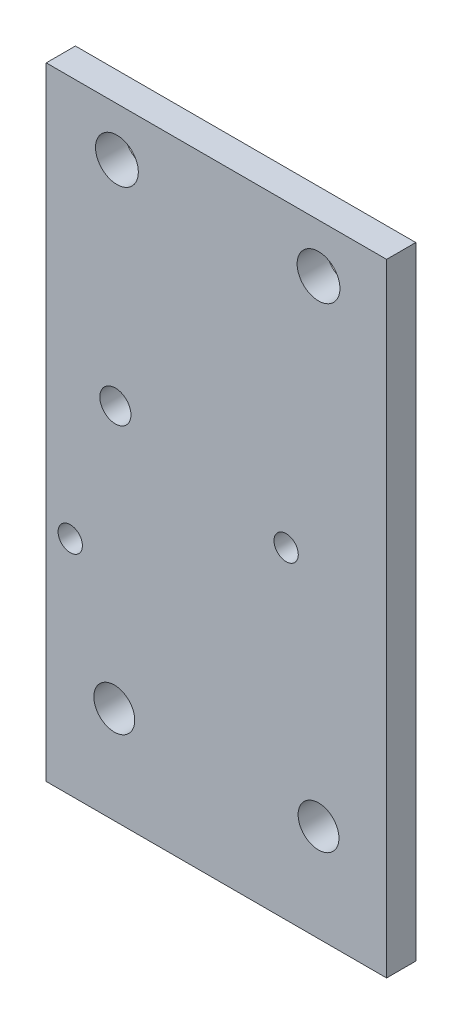
ISO-10303-21;
HEADER;
FILE_DESCRIPTION(('STEP AP214'),'2;1');
FILE_NAME('part.step','',(''),(''),'','','');
FILE_SCHEMA(('AUTOMOTIVE_DESIGN { 1 0 10303 214 1 1 1 1 }'));
ENDSEC;
DATA;
#1=APPLICATION_CONTEXT('core data for automotive mechanical design processes');
#2=APPLICATION_PROTOCOL_DEFINITION('international standard','automotive_design',2000,#1);
#3=PRODUCT_CONTEXT('',#1,'mechanical');
#4=PRODUCT('Part','Part','',(#3));
#5=PRODUCT_RELATED_PRODUCT_CATEGORY('part','',(#4));
#6=PRODUCT_DEFINITION_FORMATION('','',#4);
#7=PRODUCT_DEFINITION_CONTEXT('part definition',#1,'design');
#8=PRODUCT_DEFINITION('design','',#6,#7);
#9=PRODUCT_DEFINITION_SHAPE('','',#8);
#10=(LENGTH_UNIT() NAMED_UNIT(*) SI_UNIT(.MILLI.,.METRE.));
#11=(NAMED_UNIT(*) PLANE_ANGLE_UNIT() SI_UNIT($,.RADIAN.));
#12=(NAMED_UNIT(*) SI_UNIT($,.STERADIAN.) SOLID_ANGLE_UNIT());
#13=UNCERTAINTY_MEASURE_WITH_UNIT(LENGTH_MEASURE(1.E-05),#10,'distance_accuracy_value','');
#14=(GEOMETRIC_REPRESENTATION_CONTEXT(3) GLOBAL_UNCERTAINTY_ASSIGNED_CONTEXT((#13)) GLOBAL_UNIT_ASSIGNED_CONTEXT((#10,
#11,#12)) REPRESENTATION_CONTEXT('',''));
#15=CARTESIAN_POINT('',(0.,0.,0.));
#16=DIRECTION('',(0.,0.,1.));
#17=DIRECTION('',(1.,0.,0.));
#18=AXIS2_PLACEMENT_3D('',#15,#16,#17);
#19=CARTESIAN_POINT('',(0.,0.,3.));
#20=DIRECTION('',(0.,0.,1.));
#21=DIRECTION('',(1.,0.,0.));
#22=AXIS2_PLACEMENT_3D('',#19,#20,#21);
#23=PLANE('',#22);
#24=CARTESIAN_POINT('',(31.47,-21.64,3.));
#25=DIRECTION('',(0.,0.,1.));
#26=DIRECTION('',(1.,0.,0.));
#27=AXIS2_PLACEMENT_3D('',#24,#25,#26);
#28=CIRCLE('',#27,1.24999999999999);
#29=CARTESIAN_POINT('',(32.72,-21.64,3.));
#30=VERTEX_POINT('',#29);
#31=EDGE_CURVE('E143',#30,#30,#28,.T.);
#32=ORIENTED_EDGE('',*,*,#31,.F.);
#33=EDGE_LOOP('',(#32));
#34=FACE_BOUND('',#33,.T.);
#35=CARTESIAN_POINT('',(53.67,-11.34,3.));
#36=DIRECTION('',(0.,0.,1.));
#37=DIRECTION('',(1.,0.,0.));
#38=AXIS2_PLACEMENT_3D('',#35,#36,#37);
#39=CIRCLE('',#38,1.24999999999999);
#40=CARTESIAN_POINT('',(54.92,-11.34,3.));
#41=VERTEX_POINT('',#40);
#42=EDGE_CURVE('E135',#41,#41,#39,.T.);
#43=ORIENTED_EDGE('',*,*,#42,.F.);
#44=EDGE_LOOP('',(#43));
#45=FACE_BOUND('',#44,.T.);
#46=DIRECTION('',(1.,0.,0.));
#47=VECTOR('',#46,1.);
#48=CARTESIAN_POINT('',(29.,19.5,3.));
#49=LINE('',#48,#47);
#50=CARTESIAN_POINT('',(29.,19.5,3.));
#51=VERTEX_POINT('',#50);
#52=CARTESIAN_POINT('',(64.,19.5,3.));
#53=VERTEX_POINT('',#52);
#54=EDGE_CURVE('E76',#51,#53,#49,.T.);
#55=ORIENTED_EDGE('',*,*,#54,.F.);
#56=DIRECTION('',(0.,1.,0.));
#57=VECTOR('',#56,1.);
#58=CARTESIAN_POINT('',(29.,34.5,3.));
#59=LINE('',#58,#57);
#60=CARTESIAN_POINT('',(29.,-44.5,3.));
#61=VERTEX_POINT('',#60);
#62=EDGE_CURVE('E86',#61,#51,#59,.T.);
#63=ORIENTED_EDGE('',*,*,#62,.F.);
#64=DIRECTION('',(-1.,0.,0.));
#65=VECTOR('',#64,1.);
#66=CARTESIAN_POINT('',(21.,-44.5,3.));
#67=LINE('',#66,#65);
#68=CARTESIAN_POINT('',(64.,-44.5,3.));
#69=VERTEX_POINT('',#68);
#70=EDGE_CURVE('E119',#69,#61,#67,.T.);
#71=ORIENTED_EDGE('',*,*,#70,.F.);
#72=DIRECTION('',(0.,-1.,0.));
#73=VECTOR('',#72,1.);
#74=CARTESIAN_POINT('',(64.,24.5,3.));
#75=LINE('',#74,#73);
#76=EDGE_CURVE('E11',#53,#69,#75,.T.);
#77=ORIENTED_EDGE('',*,*,#76,.F.);
#78=EDGE_LOOP('',(#55,#63,#71,#77));
#79=FACE_BOUND('',#78,.T.);
#80=CARTESIAN_POINT('',(36.11,-7.5,3.));
#81=DIRECTION('',(0.,0.,1.));
#82=DIRECTION('',(1.,0.,0.));
#83=AXIS2_PLACEMENT_3D('',#80,#81,#82);
#84=CIRCLE('',#83,1.6);
#85=CARTESIAN_POINT('',(37.71,-7.5,3.));
#86=VERTEX_POINT('',#85);
#87=EDGE_CURVE('E95',#86,#86,#84,.T.);
#88=ORIENTED_EDGE('',*,*,#87,.F.);
#89=EDGE_LOOP('',(#88));
#90=FACE_BOUND('',#89,.T.);
#91=CARTESIAN_POINT('',(36.27,14.5,3.));
#92=DIRECTION('',(0.,0.,1.));
#93=DIRECTION('',(1.,0.,0.));
#94=AXIS2_PLACEMENT_3D('',#91,#92,#93);
#95=CIRCLE('',#94,2.2);
#96=CARTESIAN_POINT('',(38.47,14.5,3.));
#97=VERTEX_POINT('',#96);
#98=EDGE_CURVE('E111',#97,#97,#95,.T.);
#99=ORIENTED_EDGE('',*,*,#98,.F.);
#100=EDGE_LOOP('',(#99));
#101=FACE_BOUND('',#100,.T.);
#102=CARTESIAN_POINT('',(57.0000000000002,14.5,3.));
#103=DIRECTION('',(0.,0.,1.));
#104=DIRECTION('',(1.,0.,0.));
#105=AXIS2_PLACEMENT_3D('',#102,#103,#104);
#106=CIRCLE('',#105,2.2);
#107=CARTESIAN_POINT('',(59.2000000000002,14.5,3.));
#108=VERTEX_POINT('',#107);
#109=EDGE_CURVE('E106',#108,#108,#106,.T.);
#110=ORIENTED_EDGE('',*,*,#109,.F.);
#111=EDGE_LOOP('',(#110));
#112=FACE_BOUND('',#111,.T.);
#113=CARTESIAN_POINT('',(36.,-34.5,3.));
#114=DIRECTION('',(0.,0.,1.));
#115=DIRECTION('',(1.,0.,0.));
#116=AXIS2_PLACEMENT_3D('',#113,#114,#115);
#117=CIRCLE('',#116,2.1);
#118=CARTESIAN_POINT('',(38.1,-34.5,3.));
#119=VERTEX_POINT('',#118);
#120=EDGE_CURVE('E122',#119,#119,#117,.T.);
#121=ORIENTED_EDGE('',*,*,#120,.F.);
#122=EDGE_LOOP('',(#121));
#123=FACE_BOUND('',#122,.T.);
#124=CARTESIAN_POINT('',(57.,-34.5,3.));
#125=DIRECTION('',(0.,0.,1.));
#126=DIRECTION('',(1.,0.,0.));
#127=AXIS2_PLACEMENT_3D('',#124,#125,#126);
#128=CIRCLE('',#127,2.1);
#129=CARTESIAN_POINT('',(59.1,-34.5,3.));
#130=VERTEX_POINT('',#129);
#131=EDGE_CURVE('E121',#130,#130,#128,.T.);
#132=ORIENTED_EDGE('',*,*,#131,.F.);
#133=EDGE_LOOP('',(#132));
#134=FACE_BOUND('',#133,.T.);
#135=ADVANCED_FACE('F34',(#34,#45,#79,#90,#101,#112,#123,#134),#23,.T.);
#136=CARTESIAN_POINT('',(0.,0.,0.));
#137=DIRECTION('',(0.,0.,1.));
#138=DIRECTION('',(1.,0.,0.));
#139=AXIS2_PLACEMENT_3D('',#136,#137,#138);
#140=PLANE('',#139);
#141=CARTESIAN_POINT('',(31.47,-21.64,0.));
#142=DIRECTION('',(0.,0.,1.));
#143=DIRECTION('',(1.,0.,0.));
#144=AXIS2_PLACEMENT_3D('',#141,#142,#143);
#145=CIRCLE('',#144,1.24999999999999);
#146=CARTESIAN_POINT('',(32.72,-21.64,0.));
#147=VERTEX_POINT('',#146);
#148=EDGE_CURVE('E38',#147,#147,#145,.T.);
#149=ORIENTED_EDGE('',*,*,#148,.T.);
#150=EDGE_LOOP('',(#149));
#151=FACE_BOUND('',#150,.T.);
#152=CARTESIAN_POINT('',(53.67,-11.34,0.));
#153=DIRECTION('',(0.,0.,1.));
#154=DIRECTION('',(1.,0.,0.));
#155=AXIS2_PLACEMENT_3D('',#152,#153,#154);
#156=CIRCLE('',#155,1.24999999999999);
#157=CARTESIAN_POINT('',(54.92,-11.34,0.));
#158=VERTEX_POINT('',#157);
#159=EDGE_CURVE('E79',#158,#158,#156,.T.);
#160=ORIENTED_EDGE('',*,*,#159,.T.);
#161=EDGE_LOOP('',(#160));
#162=FACE_BOUND('',#161,.T.);
#163=CARTESIAN_POINT('',(36.,-34.5,0.));
#164=DIRECTION('',(0.,0.,1.));
#165=DIRECTION('',(1.,0.,0.));
#166=AXIS2_PLACEMENT_3D('',#163,#164,#165);
#167=CIRCLE('',#166,2.1);
#168=CARTESIAN_POINT('',(38.1,-34.5,0.));
#169=VERTEX_POINT('',#168);
#170=EDGE_CURVE('E129',#169,#169,#167,.T.);
#171=ORIENTED_EDGE('',*,*,#170,.T.);
#172=EDGE_LOOP('',(#171));
#173=FACE_BOUND('',#172,.T.);
#174=CARTESIAN_POINT('',(57.,-34.5,0.));
#175=DIRECTION('',(0.,0.,1.));
#176=DIRECTION('',(1.,0.,0.));
#177=AXIS2_PLACEMENT_3D('',#174,#175,#176);
#178=CIRCLE('',#177,2.1);
#179=CARTESIAN_POINT('',(59.1,-34.5,0.));
#180=VERTEX_POINT('',#179);
#181=EDGE_CURVE('E125',#180,#180,#178,.T.);
#182=ORIENTED_EDGE('',*,*,#181,.T.);
#183=EDGE_LOOP('',(#182));
#184=FACE_BOUND('',#183,.T.);
#185=CARTESIAN_POINT('',(57.0000000000002,14.5,0.));
#186=DIRECTION('',(0.,0.,-1.));
#187=DIRECTION('',(-1.,0.,0.));
#188=AXIS2_PLACEMENT_3D('',#185,#186,#187);
#189=CIRCLE('',#188,2.2);
#190=CARTESIAN_POINT('',(54.8000000000002,14.5,0.));
#191=VERTEX_POINT('',#190);
#192=EDGE_CURVE('E102',#191,#191,#189,.T.);
#193=ORIENTED_EDGE('',*,*,#192,.F.);
#194=EDGE_LOOP('',(#193));
#195=FACE_BOUND('',#194,.T.);
#196=CARTESIAN_POINT('',(36.27,14.5,0.));
#197=DIRECTION('',(0.,0.,-1.));
#198=DIRECTION('',(-1.,0.,0.));
#199=AXIS2_PLACEMENT_3D('',#196,#197,#198);
#200=CIRCLE('',#199,2.2);
#201=CARTESIAN_POINT('',(34.07,14.5,0.));
#202=VERTEX_POINT('',#201);
#203=EDGE_CURVE('E103',#202,#202,#200,.T.);
#204=ORIENTED_EDGE('',*,*,#203,.F.);
#205=EDGE_LOOP('',(#204));
#206=FACE_BOUND('',#205,.T.);
#207=CARTESIAN_POINT('',(36.11,-7.5,0.));
#208=DIRECTION('',(0.,0.,-1.));
#209=DIRECTION('',(-1.,0.,0.));
#210=AXIS2_PLACEMENT_3D('',#207,#208,#209);
#211=CIRCLE('',#210,1.6);
#212=CARTESIAN_POINT('',(34.51,-7.5,0.));
#213=VERTEX_POINT('',#212);
#214=EDGE_CURVE('E92',#213,#213,#211,.T.);
#215=ORIENTED_EDGE('',*,*,#214,.F.);
#216=EDGE_LOOP('',(#215));
#217=FACE_BOUND('',#216,.T.);
#218=DIRECTION('',(0.,-1.,0.));
#219=VECTOR('',#218,1.);
#220=CARTESIAN_POINT('',(29.,34.5,0.));
#221=LINE('',#220,#219);
#222=CARTESIAN_POINT('',(29.,19.5,0.));
#223=VERTEX_POINT('',#222);
#224=CARTESIAN_POINT('',(29.,-44.5,0.));
#225=VERTEX_POINT('',#224);
#226=EDGE_CURVE('E58',#223,#225,#221,.T.);
#227=ORIENTED_EDGE('',*,*,#226,.F.);
#228=DIRECTION('',(-1.,0.,0.));
#229=VECTOR('',#228,1.);
#230=CARTESIAN_POINT('',(29.,19.5,0.));
#231=LINE('',#230,#229);
#232=CARTESIAN_POINT('',(64.,19.5,0.));
#233=VERTEX_POINT('',#232);
#234=EDGE_CURVE('E51',#233,#223,#231,.T.);
#235=ORIENTED_EDGE('',*,*,#234,.F.);
#236=DIRECTION('',(0.,1.,0.));
#237=VECTOR('',#236,1.);
#238=CARTESIAN_POINT('',(64.,24.5,0.));
#239=LINE('',#238,#237);
#240=CARTESIAN_POINT('',(64.,-44.5,0.));
#241=VERTEX_POINT('',#240);
#242=EDGE_CURVE('E43',#241,#233,#239,.T.);
#243=ORIENTED_EDGE('',*,*,#242,.F.);
#244=DIRECTION('',(1.,0.,0.));
#245=VECTOR('',#244,1.);
#246=CARTESIAN_POINT('',(21.,-44.5,0.));
#247=LINE('',#246,#245);
#248=EDGE_CURVE('E114',#225,#241,#247,.T.);
#249=ORIENTED_EDGE('',*,*,#248,.F.);
#250=EDGE_LOOP('',(#227,#235,#243,#249));
#251=FACE_BOUND('',#250,.T.);
#252=ADVANCED_FACE('F36',(#151,#162,#173,#184,#195,#206,#217,#251),#140,.F.);
#253=CARTESIAN_POINT('',(0.,-44.5,0.));
#254=DIRECTION('',(0.,-1.,0.));
#255=DIRECTION('',(0.,0.,-1.));
#256=AXIS2_PLACEMENT_3D('',#253,#254,#255);
#257=PLANE('',#256);
#258=ORIENTED_EDGE('',*,*,#70,.T.);
#259=DIRECTION('',(0.,0.,1.));
#260=VECTOR('',#259,1.);
#261=CARTESIAN_POINT('',(29.,-44.5,0.));
#262=LINE('',#261,#260);
#263=EDGE_CURVE('E91',#225,#61,#262,.T.);
#264=ORIENTED_EDGE('',*,*,#263,.F.);
#265=ORIENTED_EDGE('',*,*,#248,.T.);
#266=DIRECTION('',(0.,0.,1.));
#267=VECTOR('',#266,1.);
#268=CARTESIAN_POINT('',(64.,-44.5,3.));
#269=LINE('',#268,#267);
#270=EDGE_CURVE('E116',#241,#69,#269,.T.);
#271=ORIENTED_EDGE('',*,*,#270,.T.);
#272=EDGE_LOOP('',(#258,#264,#265,#271));
#273=FACE_BOUND('',#272,.T.);
#274=ADVANCED_FACE('F154',(#273),#257,.T.);
#275=CARTESIAN_POINT('',(64.,0.,0.));
#276=DIRECTION('',(-1.,0.,0.));
#277=DIRECTION('',(0.,0.,1.));
#278=AXIS2_PLACEMENT_3D('',#275,#276,#277);
#279=PLANE('',#278);
#280=ORIENTED_EDGE('',*,*,#242,.T.);
#281=DIRECTION('',(0.,0.,-1.));
#282=VECTOR('',#281,1.);
#283=CARTESIAN_POINT('',(64.,19.5,3.));
#284=LINE('',#283,#282);
#285=EDGE_CURVE('E88',#53,#233,#284,.T.);
#286=ORIENTED_EDGE('',*,*,#285,.F.);
#287=ORIENTED_EDGE('',*,*,#76,.T.);
#288=ORIENTED_EDGE('',*,*,#270,.F.);
#289=EDGE_LOOP('',(#280,#286,#287,#288));
#290=FACE_BOUND('',#289,.T.);
#291=ADVANCED_FACE('F152',(#290),#279,.F.);
#292=CARTESIAN_POINT('',(57.,-34.5,-7.));
#293=DIRECTION('',(0.,0.,1.));
#294=DIRECTION('',(1.,0.,0.));
#295=AXIS2_PLACEMENT_3D('',#292,#293,#294);
#296=CYLINDRICAL_SURFACE('',#295,2.1);
#297=ORIENTED_EDGE('',*,*,#131,.T.);
#298=EDGE_LOOP('',(#297));
#299=FACE_BOUND('',#298,.T.);
#300=ORIENTED_EDGE('',*,*,#181,.F.);
#301=EDGE_LOOP('',(#300));
#302=FACE_BOUND('',#301,.T.);
#303=ADVANCED_FACE('F162',(#299,#302),#296,.F.);
#304=CARTESIAN_POINT('',(36.,-34.5,-7.));
#305=DIRECTION('',(0.,0.,1.));
#306=DIRECTION('',(1.,0.,0.));
#307=AXIS2_PLACEMENT_3D('',#304,#305,#306);
#308=CYLINDRICAL_SURFACE('',#307,2.1);
#309=ORIENTED_EDGE('',*,*,#120,.T.);
#310=EDGE_LOOP('',(#309));
#311=FACE_BOUND('',#310,.T.);
#312=ORIENTED_EDGE('',*,*,#170,.F.);
#313=EDGE_LOOP('',(#312));
#314=FACE_BOUND('',#313,.T.);
#315=ADVANCED_FACE('F177',(#311,#314),#308,.F.);
#316=CARTESIAN_POINT('',(57.0000000000002,14.5,30.));
#317=DIRECTION('',(0.,0.,-1.));
#318=DIRECTION('',(-1.,0.,0.));
#319=AXIS2_PLACEMENT_3D('',#316,#317,#318);
#320=CYLINDRICAL_SURFACE('',#319,2.2);
#321=ORIENTED_EDGE('',*,*,#109,.T.);
#322=EDGE_LOOP('',(#321));
#323=FACE_BOUND('',#322,.T.);
#324=ORIENTED_EDGE('',*,*,#192,.T.);
#325=EDGE_LOOP('',(#324));
#326=FACE_BOUND('',#325,.T.);
#327=ADVANCED_FACE('F180',(#323,#326),#320,.F.);
#328=CARTESIAN_POINT('',(36.27,14.5,30.));
#329=DIRECTION('',(0.,0.,-1.));
#330=DIRECTION('',(-1.,0.,0.));
#331=AXIS2_PLACEMENT_3D('',#328,#329,#330);
#332=CYLINDRICAL_SURFACE('',#331,2.2);
#333=ORIENTED_EDGE('',*,*,#98,.T.);
#334=EDGE_LOOP('',(#333));
#335=FACE_BOUND('',#334,.T.);
#336=ORIENTED_EDGE('',*,*,#203,.T.);
#337=EDGE_LOOP('',(#336));
#338=FACE_BOUND('',#337,.T.);
#339=ADVANCED_FACE('F185',(#335,#338),#332,.F.);
#340=CARTESIAN_POINT('',(36.11,-7.5,10.));
#341=DIRECTION('',(0.,0.,-1.));
#342=DIRECTION('',(-1.,0.,0.));
#343=AXIS2_PLACEMENT_3D('',#340,#341,#342);
#344=CYLINDRICAL_SURFACE('',#343,1.6);
#345=ORIENTED_EDGE('',*,*,#87,.T.);
#346=EDGE_LOOP('',(#345));
#347=FACE_BOUND('',#346,.T.);
#348=ORIENTED_EDGE('',*,*,#214,.T.);
#349=EDGE_LOOP('',(#348));
#350=FACE_BOUND('',#349,.T.);
#351=ADVANCED_FACE('F200',(#347,#350),#344,.F.);
#352=CARTESIAN_POINT('',(29.,0.,0.));
#353=DIRECTION('',(-1.,0.,0.));
#354=DIRECTION('',(0.,-1.,0.));
#355=AXIS2_PLACEMENT_3D('',#352,#353,#354);
#356=PLANE('',#355);
#357=DIRECTION('',(0.,0.,1.));
#358=VECTOR('',#357,1.);
#359=CARTESIAN_POINT('',(29.,19.5,3.));
#360=LINE('',#359,#358);
#361=EDGE_CURVE('E73',#223,#51,#360,.T.);
#362=ORIENTED_EDGE('',*,*,#361,.F.);
#363=ORIENTED_EDGE('',*,*,#226,.T.);
#364=ORIENTED_EDGE('',*,*,#263,.T.);
#365=ORIENTED_EDGE('',*,*,#62,.T.);
#366=EDGE_LOOP('',(#362,#363,#364,#365));
#367=FACE_BOUND('',#366,.T.);
#368=ADVANCED_FACE('F90',(#367),#356,.T.);
#369=CARTESIAN_POINT('',(0.,19.5,0.));
#370=DIRECTION('',(0.,-1.,0.));
#371=DIRECTION('',(0.,0.,-1.));
#372=AXIS2_PLACEMENT_3D('',#369,#370,#371);
#373=PLANE('',#372);
#374=ORIENTED_EDGE('',*,*,#361,.T.);
#375=ORIENTED_EDGE('',*,*,#54,.T.);
#376=ORIENTED_EDGE('',*,*,#285,.T.);
#377=ORIENTED_EDGE('',*,*,#234,.T.);
#378=EDGE_LOOP('',(#374,#375,#376,#377));
#379=FACE_BOUND('',#378,.T.);
#380=ADVANCED_FACE('F75',(#379),#373,.F.);
#381=CARTESIAN_POINT('',(53.67,-11.34,3.));
#382=DIRECTION('',(0.,0.,1.));
#383=DIRECTION('',(1.,0.,0.));
#384=AXIS2_PLACEMENT_3D('',#381,#382,#383);
#385=CYLINDRICAL_SURFACE('',#384,1.24999999999999);
#386=ORIENTED_EDGE('',*,*,#42,.T.);
#387=EDGE_LOOP('',(#386));
#388=FACE_BOUND('',#387,.T.);
#389=ORIENTED_EDGE('',*,*,#159,.F.);
#390=EDGE_LOOP('',(#389));
#391=FACE_BOUND('',#390,.T.);
#392=ADVANCED_FACE('F215',(#388,#391),#385,.F.);
#393=CARTESIAN_POINT('',(31.47,-21.64,3.));
#394=DIRECTION('',(0.,0.,1.));
#395=DIRECTION('',(1.,0.,0.));
#396=AXIS2_PLACEMENT_3D('',#393,#394,#395);
#397=CYLINDRICAL_SURFACE('',#396,1.24999999999999);
#398=ORIENTED_EDGE('',*,*,#31,.T.);
#399=EDGE_LOOP('',(#398));
#400=FACE_BOUND('',#399,.T.);
#401=ORIENTED_EDGE('',*,*,#148,.F.);
#402=EDGE_LOOP('',(#401));
#403=FACE_BOUND('',#402,.T.);
#404=ADVANCED_FACE('F218',(#400,#403),#397,.F.);
#405=CLOSED_SHELL('',(#135,#252,#274,#291,#303,#315,#327,#339,#351,#368,#380,#392,#404));
#406=MANIFOLD_SOLID_BREP('B2',#405);
#407=ADVANCED_BREP_SHAPE_REPRESENTATION('',(#18,#406),#14);
#408=SHAPE_DEFINITION_REPRESENTATION(#9,#407);
ENDSEC;
END-ISO-10303-21;
